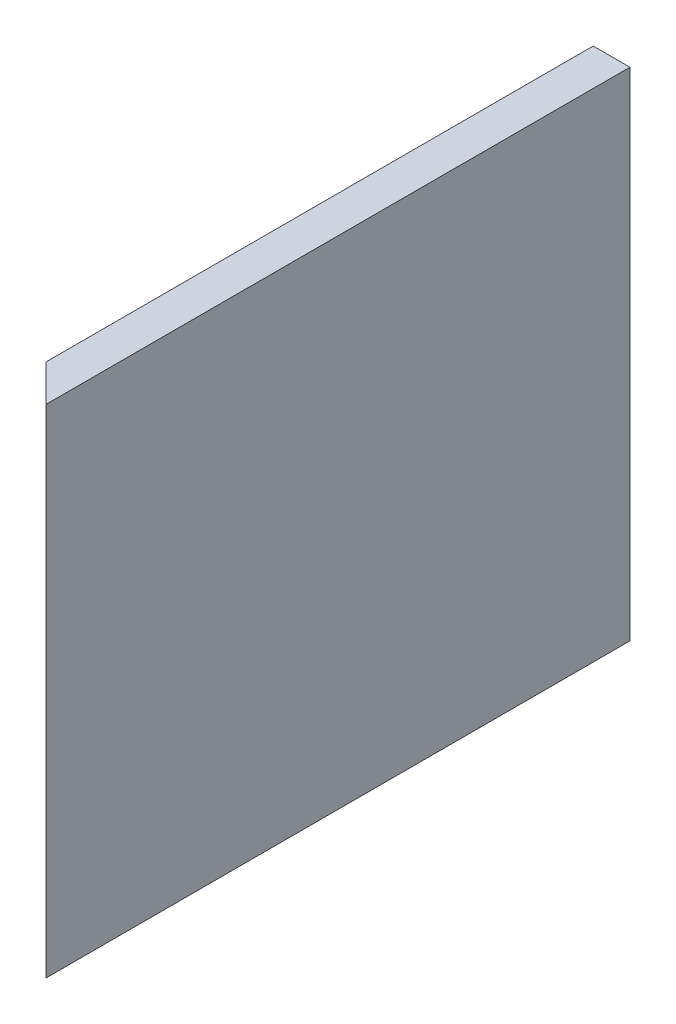
ISO-10303-21;
HEADER;
FILE_DESCRIPTION(('STEP AP214'),'2;1');
FILE_NAME('part.step','',(''),(''),'','','');
FILE_SCHEMA(('AUTOMOTIVE_DESIGN { 1 0 10303 214 1 1 1 1 }'));
ENDSEC;
DATA;
#1=APPLICATION_CONTEXT('core data for automotive mechanical design processes');
#2=APPLICATION_PROTOCOL_DEFINITION('international standard','automotive_design',2000,#1);
#3=PRODUCT_CONTEXT('',#1,'mechanical');
#4=PRODUCT('Part','Part','',(#3));
#5=PRODUCT_RELATED_PRODUCT_CATEGORY('part','',(#4));
#6=PRODUCT_DEFINITION_FORMATION('','',#4);
#7=PRODUCT_DEFINITION_CONTEXT('part definition',#1,'design');
#8=PRODUCT_DEFINITION('design','',#6,#7);
#9=PRODUCT_DEFINITION_SHAPE('','',#8);
#10=(LENGTH_UNIT() NAMED_UNIT(*) SI_UNIT(.MILLI.,.METRE.));
#11=(NAMED_UNIT(*) PLANE_ANGLE_UNIT() SI_UNIT($,.RADIAN.));
#12=(NAMED_UNIT(*) SI_UNIT($,.STERADIAN.) SOLID_ANGLE_UNIT());
#13=UNCERTAINTY_MEASURE_WITH_UNIT(LENGTH_MEASURE(1.E-05),#10,'distance_accuracy_value','');
#14=(GEOMETRIC_REPRESENTATION_CONTEXT(3) GLOBAL_UNCERTAINTY_ASSIGNED_CONTEXT((#13)) GLOBAL_UNIT_ASSIGNED_CONTEXT((#10,
#11,#12)) REPRESENTATION_CONTEXT('',''));
#15=CARTESIAN_POINT('',(0.,0.,0.));
#16=DIRECTION('',(0.,0.,1.));
#17=DIRECTION('',(1.,0.,0.));
#18=AXIS2_PLACEMENT_3D('',#15,#16,#17);
#19=CARTESIAN_POINT('',(189.128399999999,171.7294,403.340213805219));
#20=DIRECTION('',(1.,0.,0.));
#21=DIRECTION('',(0.,1.,0.));
#22=AXIS2_PLACEMENT_3D('',#19,#20,#21);
#23=PLANE('',#22);
#24=DIRECTION('',(0.,-1.,0.));
#25=VECTOR('',#24,1.);
#26=CARTESIAN_POINT('',(189.128399999999,171.729399999998,189.128399999999));
#27=LINE('',#26,#25);
#28=CARTESIAN_POINT('',(189.128399999999,171.7294,189.128399999999));
#29=VERTEX_POINT('',#28);
#30=CARTESIAN_POINT('',(189.1284,0.,189.1284));
#31=VERTEX_POINT('',#30);
#32=EDGE_CURVE('E90',#29,#31,#27,.T.);
#33=ORIENTED_EDGE('',*,*,#32,.F.);
#34=DIRECTION('',(0.,0.,-1.));
#35=VECTOR('',#34,1.);
#36=CARTESIAN_POINT('',(189.128399999999,171.7294,403.340213805219));
#37=LINE('',#36,#35);
#38=CARTESIAN_POINT('',(189.128399999999,171.7294,0.));
#39=VERTEX_POINT('',#38);
#40=EDGE_CURVE('E43',#29,#39,#37,.T.);
#41=ORIENTED_EDGE('',*,*,#40,.T.);
#42=DIRECTION('',(0.,-1.,0.));
#43=VECTOR('',#42,1.);
#44=CARTESIAN_POINT('',(189.128399999999,171.7294,0.));
#45=LINE('',#44,#43);
#46=CARTESIAN_POINT('',(189.1284,0.,0.));
#47=VERTEX_POINT('',#46);
#48=EDGE_CURVE('E88',#39,#47,#45,.T.);
#49=ORIENTED_EDGE('',*,*,#48,.T.);
#50=DIRECTION('',(0.,0.,-1.));
#51=VECTOR('',#50,1.);
#52=CARTESIAN_POINT('',(189.1284,0.,403.340213805219));
#53=LINE('',#52,#51);
#54=EDGE_CURVE('E79',#31,#47,#53,.T.);
#55=ORIENTED_EDGE('',*,*,#54,.F.);
#56=EDGE_LOOP('',(#33,#41,#49,#55));
#57=FACE_BOUND('',#56,.T.);
#58=ADVANCED_FACE('F39',(#57),#23,.F.);
#59=CARTESIAN_POINT('',(189.1284,0.,403.340213805219));
#60=DIRECTION('',(0.,1.,0.));
#61=DIRECTION('',(0.,0.,1.));
#62=AXIS2_PLACEMENT_3D('',#59,#60,#61);
#63=PLANE('',#62);
#64=DIRECTION('',(0.707106781186548,0.,0.707106781186547));
#65=VECTOR('',#64,1.);
#66=CARTESIAN_POINT('',(296.234306902609,0.,296.234306902609));
#67=LINE('',#66,#65);
#68=CARTESIAN_POINT('',(201.8284,0.,201.828399999999));
#69=VERTEX_POINT('',#68);
#70=EDGE_CURVE('E49',#31,#69,#67,.T.);
#71=ORIENTED_EDGE('',*,*,#70,.F.);
#72=ORIENTED_EDGE('',*,*,#54,.T.);
#73=DIRECTION('',(1.,0.,0.));
#74=VECTOR('',#73,1.);
#75=CARTESIAN_POINT('',(189.1284,0.,0.));
#76=LINE('',#75,#74);
#77=CARTESIAN_POINT('',(201.8284,0.,0.));
#78=VERTEX_POINT('',#77);
#79=EDGE_CURVE('E102',#47,#78,#76,.T.);
#80=ORIENTED_EDGE('',*,*,#79,.T.);
#81=DIRECTION('',(0.,0.,-1.));
#82=VECTOR('',#81,1.);
#83=CARTESIAN_POINT('',(201.8284,0.,403.340213805219));
#84=LINE('',#83,#82);
#85=EDGE_CURVE('E116',#69,#78,#84,.T.);
#86=ORIENTED_EDGE('',*,*,#85,.F.);
#87=EDGE_LOOP('',(#71,#72,#80,#86));
#88=FACE_BOUND('',#87,.T.);
#89=ADVANCED_FACE('F123',(#88),#63,.F.);
#90=CARTESIAN_POINT('',(201.8284,0.,403.340213805219));
#91=DIRECTION('',(-1.,0.,0.));
#92=DIRECTION('',(0.,-1.,0.));
#93=AXIS2_PLACEMENT_3D('',#90,#91,#92);
#94=PLANE('',#93);
#95=DIRECTION('',(0.,1.,0.));
#96=VECTOR('',#95,1.);
#97=CARTESIAN_POINT('',(201.8284,-1.46561064877707E-12,201.8284));
#98=LINE('',#97,#96);
#99=CARTESIAN_POINT('',(201.828399999999,171.7294,201.828399999999));
#100=VERTEX_POINT('',#99);
#101=EDGE_CURVE('E11',#69,#100,#98,.T.);
#102=ORIENTED_EDGE('',*,*,#101,.F.);
#103=ORIENTED_EDGE('',*,*,#85,.T.);
#104=DIRECTION('',(0.,1.,0.));
#105=VECTOR('',#104,1.);
#106=CARTESIAN_POINT('',(201.8284,0.,0.));
#107=LINE('',#106,#105);
#108=CARTESIAN_POINT('',(201.828399999999,171.7294,0.));
#109=VERTEX_POINT('',#108);
#110=EDGE_CURVE('E118',#78,#109,#107,.T.);
#111=ORIENTED_EDGE('',*,*,#110,.T.);
#112=DIRECTION('',(0.,0.,-1.));
#113=VECTOR('',#112,1.);
#114=CARTESIAN_POINT('',(201.828399999999,171.7294,403.340213805219));
#115=LINE('',#114,#113);
#116=EDGE_CURVE('E62',#100,#109,#115,.T.);
#117=ORIENTED_EDGE('',*,*,#116,.F.);
#118=EDGE_LOOP('',(#102,#103,#111,#117));
#119=FACE_BOUND('',#118,.T.);
#120=ADVANCED_FACE('F122',(#119),#94,.F.);
#121=CARTESIAN_POINT('',(201.828399999999,171.7294,403.340213805219));
#122=DIRECTION('',(0.,-1.,0.));
#123=DIRECTION('',(0.,0.,-1.));
#124=AXIS2_PLACEMENT_3D('',#121,#122,#123);
#125=PLANE('',#124);
#126=DIRECTION('',(-0.707106781186548,0.,-0.707106781186547));
#127=VECTOR('',#126,1.);
#128=CARTESIAN_POINT('',(302.584306902609,171.7294,302.584306902609));
#129=LINE('',#128,#127);
#130=EDGE_CURVE('E99',#100,#29,#129,.T.);
#131=ORIENTED_EDGE('',*,*,#130,.F.);
#132=ORIENTED_EDGE('',*,*,#116,.T.);
#133=DIRECTION('',(-1.,0.,0.));
#134=VECTOR('',#133,1.);
#135=CARTESIAN_POINT('',(201.828399999999,171.7294,0.));
#136=LINE('',#135,#134);
#137=EDGE_CURVE('E94',#109,#39,#136,.T.);
#138=ORIENTED_EDGE('',*,*,#137,.T.);
#139=ORIENTED_EDGE('',*,*,#40,.F.);
#140=EDGE_LOOP('',(#131,#132,#138,#139));
#141=FACE_BOUND('',#140,.T.);
#142=ADVANCED_FACE('F95',(#141),#125,.F.);
#143=CARTESIAN_POINT('',(0.,0.,0.));
#144=DIRECTION('',(0.,0.,1.));
#145=DIRECTION('',(1.,0.,0.));
#146=AXIS2_PLACEMENT_3D('',#143,#144,#145);
#147=PLANE('',#146);
#148=ORIENTED_EDGE('',*,*,#48,.F.);
#149=ORIENTED_EDGE('',*,*,#137,.F.);
#150=ORIENTED_EDGE('',*,*,#110,.F.);
#151=ORIENTED_EDGE('',*,*,#79,.F.);
#152=EDGE_LOOP('',(#148,#149,#150,#151));
#153=FACE_BOUND('',#152,.T.);
#154=ADVANCED_FACE('F101',(#153),#147,.F.);
#155=CARTESIAN_POINT('',(0.,0.,0.));
#156=DIRECTION('',(-0.707106781186547,0.,0.707106781186548));
#157=DIRECTION('',(0.707106781186548,0.,0.707106781186547));
#158=AXIS2_PLACEMENT_3D('',#155,#156,#157);
#159=PLANE('',#158);
#160=ORIENTED_EDGE('',*,*,#130,.T.);
#161=ORIENTED_EDGE('',*,*,#32,.T.);
#162=ORIENTED_EDGE('',*,*,#70,.T.);
#163=ORIENTED_EDGE('',*,*,#101,.T.);
#164=EDGE_LOOP('',(#160,#161,#162,#163));
#165=FACE_BOUND('',#164,.T.);
#166=ADVANCED_FACE('F41',(#165),#159,.T.);
#167=CLOSED_SHELL('',(#58,#89,#120,#142,#154,#166));
#168=MANIFOLD_SOLID_BREP('B2',#167);
#169=ADVANCED_BREP_SHAPE_REPRESENTATION('',(#18,#168),#14);
#170=SHAPE_DEFINITION_REPRESENTATION(#9,#169);
ENDSEC;
END-ISO-10303-21;
